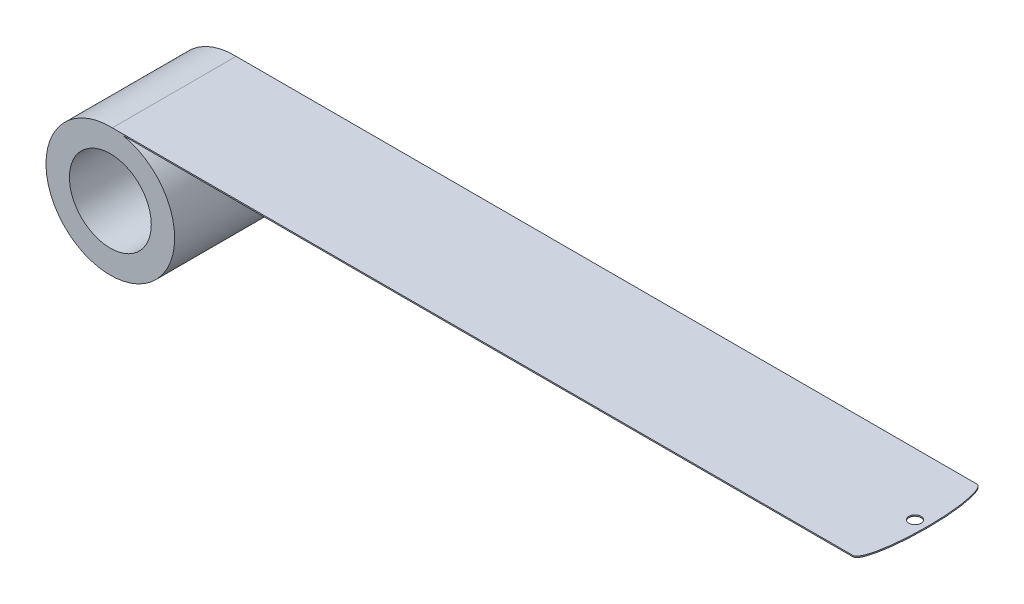
ISO-10303-21;
HEADER;
FILE_DESCRIPTION(('STEP AP214'),'2;1');
FILE_NAME('part.step','',(''),(''),'','','');
FILE_SCHEMA(('AUTOMOTIVE_DESIGN { 1 0 10303 214 1 1 1 1 }'));
ENDSEC;
DATA;
#1=APPLICATION_CONTEXT('core data for automotive mechanical design processes');
#2=APPLICATION_PROTOCOL_DEFINITION('international standard','automotive_design',2000,#1);
#3=PRODUCT_CONTEXT('',#1,'mechanical');
#4=PRODUCT('Part','Part','',(#3));
#5=PRODUCT_RELATED_PRODUCT_CATEGORY('part','',(#4));
#6=PRODUCT_DEFINITION_FORMATION('','',#4);
#7=PRODUCT_DEFINITION_CONTEXT('part definition',#1,'design');
#8=PRODUCT_DEFINITION('design','',#6,#7);
#9=PRODUCT_DEFINITION_SHAPE('','',#8);
#10=(LENGTH_UNIT() NAMED_UNIT(*) SI_UNIT(.MILLI.,.METRE.));
#11=(NAMED_UNIT(*) PLANE_ANGLE_UNIT() SI_UNIT($,.RADIAN.));
#12=(NAMED_UNIT(*) SI_UNIT($,.STERADIAN.) SOLID_ANGLE_UNIT());
#13=UNCERTAINTY_MEASURE_WITH_UNIT(LENGTH_MEASURE(1.E-05),#10,'distance_accuracy_value','');
#14=(GEOMETRIC_REPRESENTATION_CONTEXT(3) GLOBAL_UNCERTAINTY_ASSIGNED_CONTEXT((#13)) GLOBAL_UNIT_ASSIGNED_CONTEXT((#10,
#11,#12)) REPRESENTATION_CONTEXT('',''));
#15=CARTESIAN_POINT('',(0.,0.,0.));
#16=DIRECTION('',(0.,0.,1.));
#17=DIRECTION('',(1.,0.,0.));
#18=AXIS2_PLACEMENT_3D('',#15,#16,#17);
#19=CARTESIAN_POINT('',(0.,0.,50.8));
#20=DIRECTION('',(0.,0.,1.));
#21=DIRECTION('',(1.,0.,0.));
#22=AXIS2_PLACEMENT_3D('',#19,#20,#21);
#23=PLANE('',#22);
#24=DIRECTION('',(1.,0.,0.));
#25=VECTOR('',#24,1.);
#26=CARTESIAN_POINT('',(0.,26.3906,50.8));
#27=LINE('',#26,#25);
#28=CARTESIAN_POINT('',(0.81882997624695,26.3906,50.8));
#29=VERTEX_POINT('',#28);
#30=CARTESIAN_POINT('',(304.8,26.3906,50.8));
#31=VERTEX_POINT('',#30);
#32=EDGE_CURVE('E71',#29,#31,#27,.T.);
#33=ORIENTED_EDGE('',*,*,#32,.F.);
#34=CARTESIAN_POINT('',(0.,0.,50.8));
#35=DIRECTION('',(0.,0.,1.));
#36=DIRECTION('',(1.,0.,0.));
#37=AXIS2_PLACEMENT_3D('',#34,#35,#36);
#38=CIRCLE('',#37,26.4033);
#39=CARTESIAN_POINT('',(5.21778383319975,25.8826,50.8));
#40=VERTEX_POINT('',#39);
#41=EDGE_CURVE('E52',#29,#40,#38,.T.);
#42=ORIENTED_EDGE('',*,*,#41,.T.);
#43=DIRECTION('',(1.,0.,0.));
#44=VECTOR('',#43,1.);
#45=CARTESIAN_POINT('',(0.,25.8826,50.8));
#46=LINE('',#45,#44);
#47=CARTESIAN_POINT('',(304.8,25.8826,50.8));
#48=VERTEX_POINT('',#47);
#49=EDGE_CURVE('E92',#40,#48,#46,.T.);
#50=ORIENTED_EDGE('',*,*,#49,.T.);
#51=DIRECTION('',(0.,-1.,0.));
#52=VECTOR('',#51,1.);
#53=CARTESIAN_POINT('',(304.8,26.3906,50.8));
#54=LINE('',#53,#52);
#55=EDGE_CURVE('E84',#31,#48,#54,.T.);
#56=ORIENTED_EDGE('',*,*,#55,.F.);
#57=EDGE_LOOP('',(#33,#42,#50,#56));
#58=FACE_BOUND('',#57,.T.);
#59=CARTESIAN_POINT('',(0.,0.,50.8));
#60=DIRECTION('',(0.,0.,1.));
#61=DIRECTION('',(1.,0.,0.));
#62=AXIS2_PLACEMENT_3D('',#59,#60,#61);
#63=CIRCLE('',#62,16.8021);
#64=CARTESIAN_POINT('',(16.8021,0.,50.8));
#65=VERTEX_POINT('',#64);
#66=EDGE_CURVE('E97',#65,#65,#63,.T.);
#67=ORIENTED_EDGE('',*,*,#66,.F.);
#68=EDGE_LOOP('',(#67));
#69=FACE_BOUND('',#68,.T.);
#70=ADVANCED_FACE('F33',(#58,#69),#23,.T.);
#71=CARTESIAN_POINT('',(0.,0.,0.));
#72=DIRECTION('',(0.,0.,1.));
#73=DIRECTION('',(1.,0.,0.));
#74=AXIS2_PLACEMENT_3D('',#71,#72,#73);
#75=PLANE('',#74);
#76=CARTESIAN_POINT('',(0.,0.,0.));
#77=DIRECTION('',(0.,0.,1.));
#78=DIRECTION('',(1.,0.,0.));
#79=AXIS2_PLACEMENT_3D('',#76,#77,#78);
#80=CIRCLE('',#79,26.4033);
#81=CARTESIAN_POINT('',(0.81882997624695,26.3906,0.));
#82=VERTEX_POINT('',#81);
#83=CARTESIAN_POINT('',(5.21778383319975,25.8826,0.));
#84=VERTEX_POINT('',#83);
#85=EDGE_CURVE('E47',#82,#84,#80,.T.);
#86=ORIENTED_EDGE('',*,*,#85,.F.);
#87=DIRECTION('',(-1.,0.,0.));
#88=VECTOR('',#87,1.);
#89=CARTESIAN_POINT('',(0.,26.3906,0.));
#90=LINE('',#89,#88);
#91=CARTESIAN_POINT('',(304.8,26.3906,0.));
#92=VERTEX_POINT('',#91);
#93=EDGE_CURVE('E88',#92,#82,#90,.T.);
#94=ORIENTED_EDGE('',*,*,#93,.F.);
#95=DIRECTION('',(0.,-1.,0.));
#96=VECTOR('',#95,1.);
#97=CARTESIAN_POINT('',(304.8,26.3906,0.));
#98=LINE('',#97,#96);
#99=CARTESIAN_POINT('',(304.8,25.8826,0.));
#100=VERTEX_POINT('',#99);
#101=EDGE_CURVE('E86',#92,#100,#98,.T.);
#102=ORIENTED_EDGE('',*,*,#101,.T.);
#103=DIRECTION('',(-1.,0.,0.));
#104=VECTOR('',#103,1.);
#105=CARTESIAN_POINT('',(0.,25.8826,0.));
#106=LINE('',#105,#104);
#107=EDGE_CURVE('E79',#100,#84,#106,.T.);
#108=ORIENTED_EDGE('',*,*,#107,.T.);
#109=EDGE_LOOP('',(#86,#94,#102,#108));
#110=FACE_BOUND('',#109,.T.);
#111=CARTESIAN_POINT('',(0.,0.,0.));
#112=DIRECTION('',(0.,0.,1.));
#113=DIRECTION('',(1.,0.,0.));
#114=AXIS2_PLACEMENT_3D('',#111,#112,#113);
#115=CIRCLE('',#114,16.8021);
#116=CARTESIAN_POINT('',(16.8021,0.,0.));
#117=VERTEX_POINT('',#116);
#118=EDGE_CURVE('E94',#117,#117,#115,.T.);
#119=ORIENTED_EDGE('',*,*,#118,.T.);
#120=EDGE_LOOP('',(#119));
#121=FACE_BOUND('',#120,.T.);
#122=ADVANCED_FACE('F110',(#110,#121),#75,.F.);
#123=CARTESIAN_POINT('',(0.,0.,50.8));
#124=DIRECTION('',(0.,0.,-1.));
#125=DIRECTION('',(-1.,0.,0.));
#126=AXIS2_PLACEMENT_3D('',#123,#124,#125);
#127=CYLINDRICAL_SURFACE('',#126,26.4033);
#128=ORIENTED_EDGE('',*,*,#41,.F.);
#129=DIRECTION('',(0.,0.,-1.));
#130=VECTOR('',#129,1.);
#131=CARTESIAN_POINT('',(0.818829976246884,26.3906,50.8));
#132=LINE('',#131,#130);
#133=EDGE_CURVE('E11',#29,#82,#132,.T.);
#134=ORIENTED_EDGE('',*,*,#133,.T.);
#135=ORIENTED_EDGE('',*,*,#85,.T.);
#136=DIRECTION('',(0.,0.,-1.));
#137=VECTOR('',#136,1.);
#138=CARTESIAN_POINT('',(5.21778383319973,25.8826,50.8));
#139=LINE('',#138,#137);
#140=EDGE_CURVE('E41',#40,#84,#139,.T.);
#141=ORIENTED_EDGE('',*,*,#140,.F.);
#142=EDGE_LOOP('',(#128,#134,#135,#141));
#143=FACE_BOUND('',#142,.T.);
#144=ADVANCED_FACE('F35',(#143),#127,.T.);
#145=CARTESIAN_POINT('',(0.,0.,50.8));
#146=DIRECTION('',(0.,0.,-1.));
#147=DIRECTION('',(-1.,0.,0.));
#148=AXIS2_PLACEMENT_3D('',#145,#146,#147);
#149=CYLINDRICAL_SURFACE('',#148,16.8021);
#150=ORIENTED_EDGE('',*,*,#66,.T.);
#151=EDGE_LOOP('',(#150));
#152=FACE_BOUND('',#151,.T.);
#153=ORIENTED_EDGE('',*,*,#118,.F.);
#154=EDGE_LOOP('',(#153));
#155=FACE_BOUND('',#154,.T.);
#156=ADVANCED_FACE('F125',(#152,#155),#149,.F.);
#157=CARTESIAN_POINT('',(304.8,26.3906,25.4));
#158=DIRECTION('',(0.,1.,0.));
#159=DIRECTION('',(0.,0.,1.));
#160=AXIS2_PLACEMENT_3D('',#157,#158,#159);
#161=PLANE('',#160);
#162=CARTESIAN_POINT('',(304.8,26.3906,25.4));
#163=DIRECTION('',(0.,1.,0.));
#164=DIRECTION('',(0.,0.,1.));
#165=AXIS2_PLACEMENT_3D('',#162,#163,#164);
#166=CIRCLE('',#165,2.48920000000001);
#167=CARTESIAN_POINT('',(304.8,26.3906,27.8892));
#168=VERTEX_POINT('',#167);
#169=EDGE_CURVE('E116',#168,#168,#166,.T.);
#170=ORIENTED_EDGE('',*,*,#169,.F.);
#171=EDGE_LOOP('',(#170));
#172=FACE_BOUND('',#171,.T.);
#173=ORIENTED_EDGE('',*,*,#133,.F.);
#174=ORIENTED_EDGE('',*,*,#32,.T.);
#175=CARTESIAN_POINT('',(304.8,26.3906,25.4));
#176=DIRECTION('',(0.,1.,0.));
#177=DIRECTION('',(0.,0.,-1.));
#178=AXIS2_PLACEMENT_3D('',#175,#176,#177);
#179=ELLIPSE('',#178,25.4,4.96076596719774);
#180=EDGE_CURVE('E75',#31,#92,#179,.T.);
#181=ORIENTED_EDGE('',*,*,#180,.T.);
#182=ORIENTED_EDGE('',*,*,#93,.T.);
#183=EDGE_LOOP('',(#173,#174,#181,#182));
#184=FACE_BOUND('',#183,.T.);
#185=ADVANCED_FACE('F73',(#172,#184),#161,.T.);
#186=CARTESIAN_POINT('',(304.8,25.8826,25.4));
#187=DIRECTION('',(0.,1.,0.));
#188=DIRECTION('',(0.,0.,1.));
#189=AXIS2_PLACEMENT_3D('',#186,#187,#188);
#190=PLANE('',#189);
#191=CARTESIAN_POINT('',(304.8,25.8826,25.4));
#192=DIRECTION('',(0.,1.,0.));
#193=DIRECTION('',(0.,0.,1.));
#194=AXIS2_PLACEMENT_3D('',#191,#192,#193);
#195=CIRCLE('',#194,2.48920000000001);
#196=CARTESIAN_POINT('',(304.8,25.8826,27.8892));
#197=VERTEX_POINT('',#196);
#198=EDGE_CURVE('E198',#197,#197,#195,.T.);
#199=ORIENTED_EDGE('',*,*,#198,.T.);
#200=EDGE_LOOP('',(#199));
#201=FACE_BOUND('',#200,.T.);
#202=ORIENTED_EDGE('',*,*,#49,.F.);
#203=ORIENTED_EDGE('',*,*,#140,.T.);
#204=ORIENTED_EDGE('',*,*,#107,.F.);
#205=CARTESIAN_POINT('',(304.8,25.8826,25.4));
#206=DIRECTION('',(0.,1.,0.));
#207=DIRECTION('',(0.,0.,-1.));
#208=AXIS2_PLACEMENT_3D('',#205,#206,#207);
#209=ELLIPSE('',#208,25.4,4.96076596719774);
#210=EDGE_CURVE('E112',#48,#100,#209,.T.);
#211=ORIENTED_EDGE('',*,*,#210,.F.);
#212=EDGE_LOOP('',(#202,#203,#204,#211));
#213=FACE_BOUND('',#212,.T.);
#214=ADVANCED_FACE('F108',(#201,#213),#190,.F.);
#215=DIRECTION('',(0.,-1.,0.));
#216=VECTOR('',#215,1.);
#217=SURFACE_OF_LINEAR_EXTRUSION('',#179,#216);
#218=ORIENTED_EDGE('',*,*,#210,.T.);
#219=ORIENTED_EDGE('',*,*,#101,.F.);
#220=ORIENTED_EDGE('',*,*,#180,.F.);
#221=ORIENTED_EDGE('',*,*,#55,.T.);
#222=EDGE_LOOP('',(#218,#219,#220,#221));
#223=FACE_BOUND('',#222,.T.);
#224=ADVANCED_FACE('F83',(#223),#217,.F.);
#225=CARTESIAN_POINT('',(304.8,26.3906,25.4));
#226=DIRECTION('',(0.,-1.,0.));
#227=DIRECTION('',(0.,0.,-1.));
#228=AXIS2_PLACEMENT_3D('',#225,#226,#227);
#229=CYLINDRICAL_SURFACE('',#228,2.48920000000001);
#230=ORIENTED_EDGE('',*,*,#169,.T.);
#231=EDGE_LOOP('',(#230));
#232=FACE_BOUND('',#231,.T.);
#233=ORIENTED_EDGE('',*,*,#198,.F.);
#234=EDGE_LOOP('',(#233));
#235=FACE_BOUND('',#234,.T.);
#236=ADVANCED_FACE('F123',(#232,#235),#229,.F.);
#237=CLOSED_SHELL('',(#70,#122,#144,#156,#185,#214,#224,#236));
#238=MANIFOLD_SOLID_BREP('B2',#237);
#239=ADVANCED_BREP_SHAPE_REPRESENTATION('',(#18,#238),#14);
#240=SHAPE_DEFINITION_REPRESENTATION(#9,#239);
ENDSEC;
END-ISO-10303-21;
